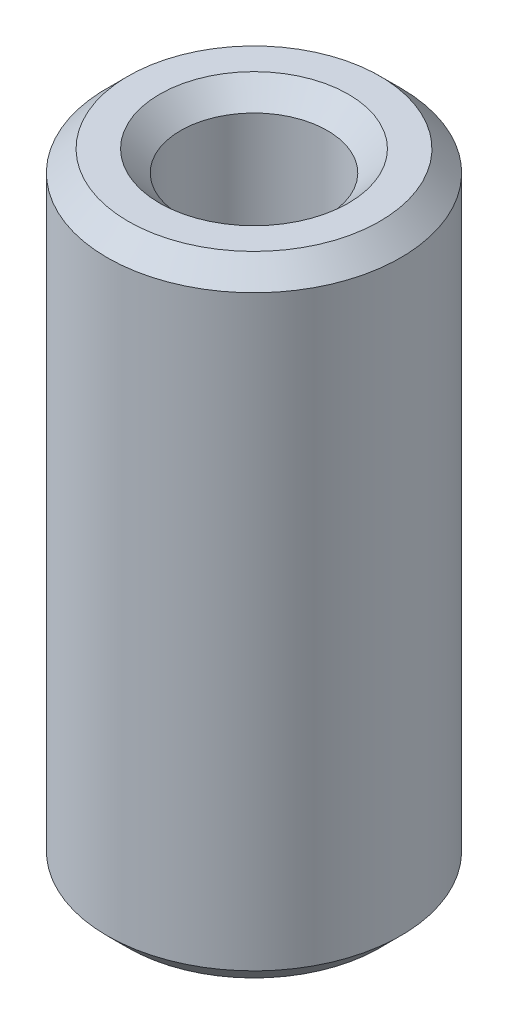
ISO-10303-21;
HEADER;
FILE_DESCRIPTION(('STEP AP214'),'2;1');
FILE_NAME('part.step','',(''),(''),'','','');
FILE_SCHEMA(('AUTOMOTIVE_DESIGN { 1 0 10303 214 1 1 1 1 }'));
ENDSEC;
DATA;
#1=APPLICATION_CONTEXT('core data for automotive mechanical design processes');
#2=APPLICATION_PROTOCOL_DEFINITION('international standard','automotive_design',2000,#1);
#3=PRODUCT_CONTEXT('',#1,'mechanical');
#4=PRODUCT('Part','Part','',(#3));
#5=PRODUCT_RELATED_PRODUCT_CATEGORY('part','',(#4));
#6=PRODUCT_DEFINITION_FORMATION('','',#4);
#7=PRODUCT_DEFINITION_CONTEXT('part definition',#1,'design');
#8=PRODUCT_DEFINITION('design','',#6,#7);
#9=PRODUCT_DEFINITION_SHAPE('','',#8);
#10=(LENGTH_UNIT() NAMED_UNIT(*) SI_UNIT(.MILLI.,.METRE.));
#11=(NAMED_UNIT(*) PLANE_ANGLE_UNIT() SI_UNIT($,.RADIAN.));
#12=(NAMED_UNIT(*) SI_UNIT($,.STERADIAN.) SOLID_ANGLE_UNIT());
#13=UNCERTAINTY_MEASURE_WITH_UNIT(LENGTH_MEASURE(1.E-05),#10,'distance_accuracy_value','');
#14=(GEOMETRIC_REPRESENTATION_CONTEXT(3) GLOBAL_UNCERTAINTY_ASSIGNED_CONTEXT((#13)) GLOBAL_UNIT_ASSIGNED_CONTEXT((#10,
#11,#12)) REPRESENTATION_CONTEXT('',''));
#15=CARTESIAN_POINT('',(0.,0.,0.));
#16=DIRECTION('',(0.,0.,1.));
#17=DIRECTION('',(1.,0.,0.));
#18=AXIS2_PLACEMENT_3D('',#15,#16,#17);
#19=CARTESIAN_POINT('',(0.,15.,0.));
#20=DIRECTION('',(0.,1.,0.));
#21=DIRECTION('',(0.,0.,1.));
#22=AXIS2_PLACEMENT_3D('',#19,#20,#21);
#23=PLANE('',#22);
#24=CARTESIAN_POINT('',(0.,15.,0.));
#25=DIRECTION('',(0.,1.,0.));
#26=DIRECTION('',(0.,0.,1.));
#27=AXIS2_PLACEMENT_3D('',#24,#25,#26);
#28=CIRCLE('',#27,2.25);
#29=CARTESIAN_POINT('',(0.,15.,2.25));
#30=VERTEX_POINT('',#29);
#31=EDGE_CURVE('E10',#30,#30,#28,.F.);
#32=ORIENTED_EDGE('',*,*,#31,.T.);
#33=EDGE_LOOP('',(#32));
#34=FACE_BOUND('',#33,.T.);
#35=CARTESIAN_POINT('',(0.,15.,0.));
#36=DIRECTION('',(0.,1.,0.));
#37=DIRECTION('',(0.,0.,1.));
#38=AXIS2_PLACEMENT_3D('',#35,#36,#37);
#39=CIRCLE('',#38,3.);
#40=CARTESIAN_POINT('',(0.,15.,3.));
#41=VERTEX_POINT('',#40);
#42=EDGE_CURVE('E48',#41,#41,#39,.T.);
#43=ORIENTED_EDGE('',*,*,#42,.T.);
#44=EDGE_LOOP('',(#43));
#45=FACE_BOUND('',#44,.T.);
#46=ADVANCED_FACE('F39',(#34,#45),#23,.T.);
#47=CARTESIAN_POINT('',(0.,0.,0.));
#48=DIRECTION('',(0.,1.,0.));
#49=DIRECTION('',(0.,0.,1.));
#50=AXIS2_PLACEMENT_3D('',#47,#48,#49);
#51=PLANE('',#50);
#52=CARTESIAN_POINT('',(0.,0.,0.));
#53=DIRECTION('',(0.,1.,0.));
#54=DIRECTION('',(0.,0.,1.));
#55=AXIS2_PLACEMENT_3D('',#52,#53,#54);
#56=CIRCLE('',#55,2.25);
#57=CARTESIAN_POINT('',(0.,0.,2.25));
#58=VERTEX_POINT('',#57);
#59=EDGE_CURVE('E72',#58,#58,#56,.T.);
#60=ORIENTED_EDGE('',*,*,#59,.T.);
#61=EDGE_LOOP('',(#60));
#62=FACE_BOUND('',#61,.T.);
#63=CARTESIAN_POINT('',(0.,0.,0.));
#64=DIRECTION('',(0.,1.,0.));
#65=DIRECTION('',(0.,0.,1.));
#66=AXIS2_PLACEMENT_3D('',#63,#64,#65);
#67=CIRCLE('',#66,3.);
#68=CARTESIAN_POINT('',(0.,0.,3.));
#69=VERTEX_POINT('',#68);
#70=EDGE_CURVE('E76',#69,#69,#67,.F.);
#71=ORIENTED_EDGE('',*,*,#70,.T.);
#72=EDGE_LOOP('',(#71));
#73=FACE_BOUND('',#72,.T.);
#74=ADVANCED_FACE('F81',(#62,#73),#51,.F.);
#75=CARTESIAN_POINT('',(0.,15.,0.));
#76=DIRECTION('',(0.,-1.,0.));
#77=DIRECTION('',(0.,0.,-1.));
#78=AXIS2_PLACEMENT_3D('',#75,#76,#77);
#79=CYLINDRICAL_SURFACE('',#78,3.5);
#80=CARTESIAN_POINT('',(0.,0.5,0.));
#81=DIRECTION('',(0.,1.,0.));
#82=DIRECTION('',(0.,0.,1.));
#83=AXIS2_PLACEMENT_3D('',#80,#81,#82);
#84=CIRCLE('',#83,3.5);
#85=CARTESIAN_POINT('',(0.,0.5,3.5));
#86=VERTEX_POINT('',#85);
#87=EDGE_CURVE('E53',#86,#86,#84,.T.);
#88=ORIENTED_EDGE('',*,*,#87,.T.);
#89=EDGE_LOOP('',(#88));
#90=FACE_BOUND('',#89,.T.);
#91=CARTESIAN_POINT('',(0.,14.5,0.));
#92=DIRECTION('',(0.,1.,0.));
#93=DIRECTION('',(0.,0.,1.));
#94=AXIS2_PLACEMENT_3D('',#91,#92,#93);
#95=CIRCLE('',#94,3.5);
#96=CARTESIAN_POINT('',(0.,14.5,3.5));
#97=VERTEX_POINT('',#96);
#98=EDGE_CURVE('E58',#97,#97,#95,.F.);
#99=ORIENTED_EDGE('',*,*,#98,.T.);
#100=EDGE_LOOP('',(#99));
#101=FACE_BOUND('',#100,.T.);
#102=ADVANCED_FACE('F91',(#90,#101),#79,.T.);
#103=CARTESIAN_POINT('',(0.,15.,0.));
#104=DIRECTION('',(0.,-1.,0.));
#105=DIRECTION('',(0.,0.,-1.));
#106=AXIS2_PLACEMENT_3D('',#103,#104,#105);
#107=CYLINDRICAL_SURFACE('',#106,1.75);
#108=CARTESIAN_POINT('',(0.,0.499999999999999,0.));
#109=DIRECTION('',(0.,1.,0.));
#110=DIRECTION('',(0.,0.,1.));
#111=AXIS2_PLACEMENT_3D('',#108,#109,#110);
#112=CIRCLE('',#111,1.75);
#113=CARTESIAN_POINT('',(0.,0.499999999999999,1.75));
#114=VERTEX_POINT('',#113);
#115=EDGE_CURVE('E64',#114,#114,#112,.F.);
#116=ORIENTED_EDGE('',*,*,#115,.T.);
#117=EDGE_LOOP('',(#116));
#118=FACE_BOUND('',#117,.T.);
#119=CARTESIAN_POINT('',(0.,14.5,0.));
#120=DIRECTION('',(0.,1.,0.));
#121=DIRECTION('',(0.,0.,1.));
#122=AXIS2_PLACEMENT_3D('',#119,#120,#121);
#123=CIRCLE('',#122,1.75);
#124=CARTESIAN_POINT('',(0.,14.5,1.75));
#125=VERTEX_POINT('',#124);
#126=EDGE_CURVE('E68',#125,#125,#123,.T.);
#127=ORIENTED_EDGE('',*,*,#126,.T.);
#128=EDGE_LOOP('',(#127));
#129=FACE_BOUND('',#128,.T.);
#130=ADVANCED_FACE('F94',(#118,#129),#107,.F.);
#131=CARTESIAN_POINT('',(0.,0.,0.));
#132=DIRECTION('',(0.,-1.,0.));
#133=DIRECTION('',(0.,0.,-1.));
#134=AXIS2_PLACEMENT_3D('',#131,#132,#133);
#135=CONICAL_SURFACE('',#134,2.25,0.785398163397448);
#136=ORIENTED_EDGE('',*,*,#115,.F.);
#137=EDGE_LOOP('',(#136));
#138=FACE_BOUND('',#137,.T.);
#139=ORIENTED_EDGE('',*,*,#59,.F.);
#140=EDGE_LOOP('',(#139));
#141=FACE_BOUND('',#140,.T.);
#142=ADVANCED_FACE('F87',(#138,#141),#135,.F.);
#143=CARTESIAN_POINT('',(0.,0.5,0.));
#144=DIRECTION('',(0.,1.,0.));
#145=DIRECTION('',(0.,0.,1.));
#146=AXIS2_PLACEMENT_3D('',#143,#144,#145);
#147=CONICAL_SURFACE('',#146,3.5,0.78539816339745);
#148=ORIENTED_EDGE('',*,*,#70,.F.);
#149=EDGE_LOOP('',(#148));
#150=FACE_BOUND('',#149,.T.);
#151=ORIENTED_EDGE('',*,*,#87,.F.);
#152=EDGE_LOOP('',(#151));
#153=FACE_BOUND('',#152,.T.);
#154=ADVANCED_FACE('F83',(#150,#153),#147,.T.);
#155=CARTESIAN_POINT('',(0.,14.5,0.));
#156=DIRECTION('',(0.,1.,0.));
#157=DIRECTION('',(0.,0.,1.));
#158=AXIS2_PLACEMENT_3D('',#155,#156,#157);
#159=CONICAL_SURFACE('',#158,1.75,0.785398163397448);
#160=ORIENTED_EDGE('',*,*,#31,.F.);
#161=EDGE_LOOP('',(#160));
#162=FACE_BOUND('',#161,.T.);
#163=ORIENTED_EDGE('',*,*,#126,.F.);
#164=EDGE_LOOP('',(#163));
#165=FACE_BOUND('',#164,.T.);
#166=ADVANCED_FACE('F86',(#162,#165),#159,.F.);
#167=CARTESIAN_POINT('',(0.,15.,0.));
#168=DIRECTION('',(0.,-1.,0.));
#169=DIRECTION('',(0.,0.,-1.));
#170=AXIS2_PLACEMENT_3D('',#167,#168,#169);
#171=CONICAL_SURFACE('',#170,3.,0.78539816339745);
#172=ORIENTED_EDGE('',*,*,#98,.F.);
#173=EDGE_LOOP('',(#172));
#174=FACE_BOUND('',#173,.T.);
#175=ORIENTED_EDGE('',*,*,#42,.F.);
#176=EDGE_LOOP('',(#175));
#177=FACE_BOUND('',#176,.T.);
#178=ADVANCED_FACE('F42',(#174,#177),#171,.T.);
#179=CLOSED_SHELL('',(#46,#74,#102,#130,#142,#154,#166,#178));
#180=MANIFOLD_SOLID_BREP('B2',#179);
#181=ADVANCED_BREP_SHAPE_REPRESENTATION('',(#18,#180),#14);
#182=SHAPE_DEFINITION_REPRESENTATION(#9,#181);
ENDSEC;
END-ISO-10303-21;
